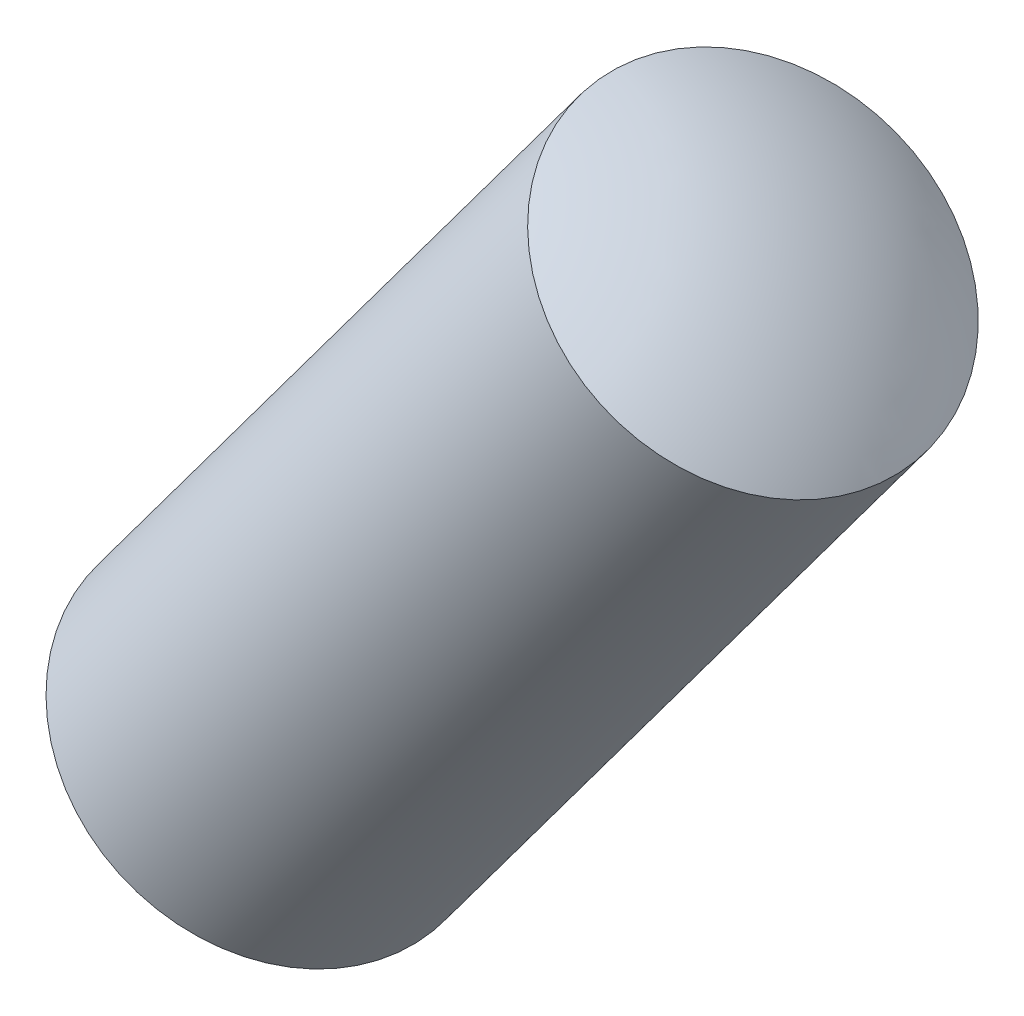
ISO-10303-21;
HEADER;
FILE_DESCRIPTION(('STEP AP214'),'2;1');
FILE_NAME('part.step','',(''),(''),'','','');
FILE_SCHEMA(('AUTOMOTIVE_DESIGN { 1 0 10303 214 1 1 1 1 }'));
ENDSEC;
DATA;
#1=APPLICATION_CONTEXT('core data for automotive mechanical design processes');
#2=APPLICATION_PROTOCOL_DEFINITION('international standard','automotive_design',2000,#1);
#3=PRODUCT_CONTEXT('',#1,'mechanical');
#4=PRODUCT('Part','Part','',(#3));
#5=PRODUCT_RELATED_PRODUCT_CATEGORY('part','',(#4));
#6=PRODUCT_DEFINITION_FORMATION('','',#4);
#7=PRODUCT_DEFINITION_CONTEXT('part definition',#1,'design');
#8=PRODUCT_DEFINITION('design','',#6,#7);
#9=PRODUCT_DEFINITION_SHAPE('','',#8);
#10=(LENGTH_UNIT() NAMED_UNIT(*) SI_UNIT(.MILLI.,.METRE.));
#11=(NAMED_UNIT(*) PLANE_ANGLE_UNIT() SI_UNIT($,.RADIAN.));
#12=(NAMED_UNIT(*) SI_UNIT($,.STERADIAN.) SOLID_ANGLE_UNIT());
#13=UNCERTAINTY_MEASURE_WITH_UNIT(LENGTH_MEASURE(1.E-05),#10,'distance_accuracy_value','');
#14=(GEOMETRIC_REPRESENTATION_CONTEXT(3) GLOBAL_UNCERTAINTY_ASSIGNED_CONTEXT((#13)) GLOBAL_UNIT_ASSIGNED_CONTEXT((#10,
#11,#12)) REPRESENTATION_CONTEXT('',''));
#15=CARTESIAN_POINT('',(0.,0.,0.));
#16=DIRECTION('',(0.,0.,1.));
#17=DIRECTION('',(1.,0.,0.));
#18=AXIS2_PLACEMENT_3D('',#15,#16,#17);
#19=CARTESIAN_POINT('',(13.321991018834,17.8995043774435,0.6));
#20=DIRECTION('',(0.80220253374284,-0.59705200347756,0.));
#21=DIRECTION('',(0.597052003477559,0.80220253374284,0.));
#22=AXIS2_PLACEMENT_3D('',#19,#20,#21);
#23=SPHERICAL_SURFACE('',#22,2.);
#24=CARTESIAN_POINT('',(13.321991018834,17.8995043774435,0.6));
#25=DIRECTION('',(-0.597052003477559,-0.80220253374284,0.));
#26=DIRECTION('',(0.,0.,-1.));
#27=AXIS2_PLACEMENT_3D('',#24,#25,#26);
#28=SPHERICAL_SURFACE('',#27,2.);
#29=CARTESIAN_POINT('',(14.3561154236179,19.2889599238466,0.599999999999989));
#30=DIRECTION('',(-0.597052003477559,-0.80220253374284,0.));
#31=DIRECTION('',(0.,0.,-1.));
#32=AXIS2_PLACEMENT_3D('',#29,#30,#31);
#33=CIRCLE('',#32,1.);
#34=CARTESIAN_POINT('',(14.3561154236179,19.2889599238466,-0.400000000000011));
#35=VERTEX_POINT('',#34);
#36=EDGE_CURVE('E11',#35,#35,#33,.T.);
#37=ORIENTED_EDGE('',*,*,#36,.F.);
#38=EDGE_LOOP('',(#37));
#39=FACE_BOUND('',#38,.T.);
#40=ADVANCED_FACE('F17',(#39),#28,.T.);
#41=CARTESIAN_POINT('',(12.6497711324398,16.9963058403701,0.599999999999989));
#42=DIRECTION('',(0.80220253374284,-0.59705200347756,0.));
#43=DIRECTION('',(-0.597052003477559,-0.80220253374284,0.));
#44=AXIS2_PLACEMENT_3D('',#41,#42,#43);
#45=SPHERICAL_SURFACE('',#44,2.);
#46=CARTESIAN_POINT('',(12.6497711324398,16.9963058403701,0.599999999999989));
#47=DIRECTION('',(-0.597052003477559,-0.80220253374284,0.));
#48=DIRECTION('',(0.,0.,-1.));
#49=AXIS2_PLACEMENT_3D('',#46,#47,#48);
#50=SPHERICAL_SURFACE('',#49,2.);
#51=CARTESIAN_POINT('',(11.6156467276559,15.6068502939669,0.6));
#52=DIRECTION('',(-0.597052003477559,-0.80220253374284,0.));
#53=DIRECTION('',(0.,0.,-1.));
#54=AXIS2_PLACEMENT_3D('',#51,#52,#53);
#55=CIRCLE('',#54,1.);
#56=CARTESIAN_POINT('',(11.6156467276559,15.6068502939669,-0.4));
#57=VERTEX_POINT('',#56);
#58=EDGE_CURVE('E26',#57,#57,#55,.T.);
#59=ORIENTED_EDGE('',*,*,#58,.T.);
#60=EDGE_LOOP('',(#59));
#61=FACE_BOUND('',#60,.T.);
#62=ADVANCED_FACE('F40',(#61),#50,.T.);
#63=CARTESIAN_POINT('',(12.3007639016464,16.5273777014368,0.599999999999989));
#64=DIRECTION('',(-0.597052003477559,-0.80220253374284,0.));
#65=DIRECTION('',(0.,0.,-1.));
#66=AXIS2_PLACEMENT_3D('',#63,#64,#65);
#67=CYLINDRICAL_SURFACE('',#66,1.);
#68=ORIENTED_EDGE('',*,*,#36,.T.);
#69=EDGE_LOOP('',(#68));
#70=FACE_BOUND('',#69,.T.);
#71=ORIENTED_EDGE('',*,*,#58,.F.);
#72=EDGE_LOOP('',(#71));
#73=FACE_BOUND('',#72,.T.);
#74=ADVANCED_FACE('F19',(#70,#73),#67,.T.);
#75=CLOSED_SHELL('',(#40,#62,#74));
#76=MANIFOLD_SOLID_BREP('B1',#75);
#77=ADVANCED_BREP_SHAPE_REPRESENTATION('',(#18,#76),#14);
#78=SHAPE_DEFINITION_REPRESENTATION(#9,#77);
ENDSEC;
END-ISO-10303-21;
